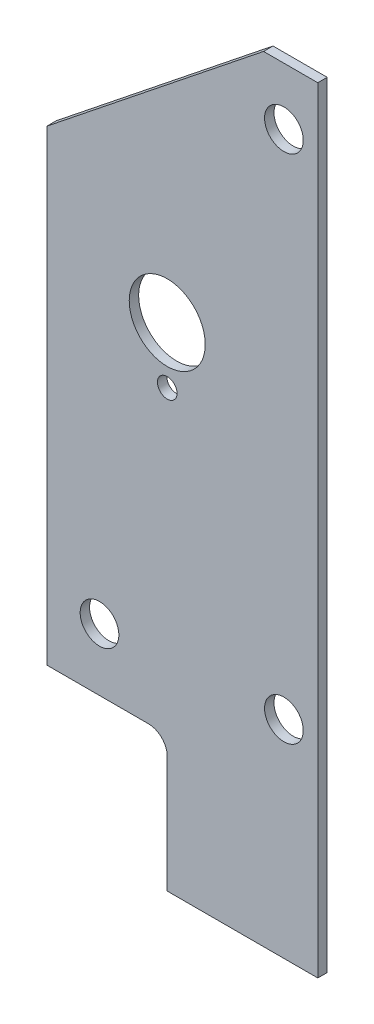
ISO-10303-21;
HEADER;
FILE_DESCRIPTION(('STEP AP214'),'2;1');
FILE_NAME('part.step','',(''),(''),'','','');
FILE_SCHEMA(('AUTOMOTIVE_DESIGN { 1 0 10303 214 1 1 1 1 }'));
ENDSEC;
DATA;
#1=APPLICATION_CONTEXT('core data for automotive mechanical design processes');
#2=APPLICATION_PROTOCOL_DEFINITION('international standard','automotive_design',2000,#1);
#3=PRODUCT_CONTEXT('',#1,'mechanical');
#4=PRODUCT('Part','Part','',(#3));
#5=PRODUCT_RELATED_PRODUCT_CATEGORY('part','',(#4));
#6=PRODUCT_DEFINITION_FORMATION('','',#4);
#7=PRODUCT_DEFINITION_CONTEXT('part definition',#1,'design');
#8=PRODUCT_DEFINITION('design','',#6,#7);
#9=PRODUCT_DEFINITION_SHAPE('','',#8);
#10=(LENGTH_UNIT() NAMED_UNIT(*) SI_UNIT(.MILLI.,.METRE.));
#11=(NAMED_UNIT(*) PLANE_ANGLE_UNIT() SI_UNIT($,.RADIAN.));
#12=(NAMED_UNIT(*) SI_UNIT($,.STERADIAN.) SOLID_ANGLE_UNIT());
#13=UNCERTAINTY_MEASURE_WITH_UNIT(LENGTH_MEASURE(1.E-05),#10,'distance_accuracy_value','');
#14=(GEOMETRIC_REPRESENTATION_CONTEXT(3) GLOBAL_UNCERTAINTY_ASSIGNED_CONTEXT((#13)) GLOBAL_UNIT_ASSIGNED_CONTEXT((#10,
#11,#12)) REPRESENTATION_CONTEXT('',''));
#15=CARTESIAN_POINT('',(0.,0.,0.));
#16=DIRECTION('',(0.,0.,1.));
#17=DIRECTION('',(1.,0.,0.));
#18=AXIS2_PLACEMENT_3D('',#15,#16,#17);
#19=CARTESIAN_POINT('',(-22.86,65.405,1.5875));
#20=DIRECTION('',(0.,0.,1.));
#21=DIRECTION('',(1.,0.,0.));
#22=AXIS2_PLACEMENT_3D('',#19,#20,#21);
#23=PLANE('',#22);
#24=CARTESIAN_POINT('',(-5.715,121.158,1.5875));
#25=DIRECTION('',(0.,0.,-1.));
#26=DIRECTION('',(-1.,0.,0.));
#27=AXIS2_PLACEMENT_3D('',#24,#25,#26);
#28=CIRCLE('',#27,3.2639);
#29=CARTESIAN_POINT('',(-8.9789,121.158,1.5875));
#30=VERTEX_POINT('',#29);
#31=EDGE_CURVE('E136',#30,#30,#28,.T.);
#32=ORIENTED_EDGE('',*,*,#31,.T.);
#33=EDGE_LOOP('',(#32));
#34=FACE_BOUND('',#33,.T.);
#35=CARTESIAN_POINT('',(-5.715,34.925,1.5875));
#36=DIRECTION('',(0.,0.,-1.));
#37=DIRECTION('',(-1.,0.,0.));
#38=AXIS2_PLACEMENT_3D('',#35,#36,#37);
#39=CIRCLE('',#38,3.2639);
#40=CARTESIAN_POINT('',(-8.9789,34.925,1.5875));
#41=VERTEX_POINT('',#40);
#42=EDGE_CURVE('E188',#41,#41,#39,.T.);
#43=ORIENTED_EDGE('',*,*,#42,.T.);
#44=EDGE_LOOP('',(#43));
#45=FACE_BOUND('',#44,.T.);
#46=CARTESIAN_POINT('',(-36.83,33.3375,1.5875));
#47=DIRECTION('',(0.,0.,-1.));
#48=DIRECTION('',(-1.,0.,0.));
#49=AXIS2_PLACEMENT_3D('',#46,#47,#48);
#50=CIRCLE('',#49,3.2639);
#51=CARTESIAN_POINT('',(-40.0939,33.3375,1.5875));
#52=VERTEX_POINT('',#51);
#53=EDGE_CURVE('E191',#52,#52,#50,.T.);
#54=ORIENTED_EDGE('',*,*,#53,.T.);
#55=EDGE_LOOP('',(#54));
#56=FACE_BOUND('',#55,.T.);
#57=CARTESIAN_POINT('',(-25.4,83.058,1.5875));
#58=DIRECTION('',(0.,0.,-1.));
#59=DIRECTION('',(-1.,0.,0.));
#60=AXIS2_PLACEMENT_3D('',#57,#58,#59);
#61=CIRCLE('',#60,6.4135);
#62=CARTESIAN_POINT('',(-31.8135,83.058,1.5875));
#63=VERTEX_POINT('',#62);
#64=EDGE_CURVE('E194',#63,#63,#61,.T.);
#65=ORIENTED_EDGE('',*,*,#64,.T.);
#66=EDGE_LOOP('',(#65));
#67=FACE_BOUND('',#66,.T.);
#68=CARTESIAN_POINT('',(-25.4,73.533,1.5875));
#69=DIRECTION('',(0.,0.,-1.));
#70=DIRECTION('',(-1.,0.,0.));
#71=AXIS2_PLACEMENT_3D('',#68,#69,#70);
#72=CIRCLE('',#71,1.651);
#73=CARTESIAN_POINT('',(-27.051,73.533,1.5875));
#74=VERTEX_POINT('',#73);
#75=EDGE_CURVE('E196',#74,#74,#72,.T.);
#76=ORIENTED_EDGE('',*,*,#75,.T.);
#77=EDGE_LOOP('',(#76));
#78=FACE_BOUND('',#77,.T.);
#79=DIRECTION('',(1.,0.,0.));
#80=VECTOR('',#79,1.);
#81=CARTESIAN_POINT('',(-25.4,0.,1.5875));
#82=LINE('',#81,#80);
#83=CARTESIAN_POINT('',(0.,0.,1.5875));
#84=VERTEX_POINT('',#83);
#85=CARTESIAN_POINT('',(-25.4,0.,1.5875));
#86=VERTEX_POINT('',#85);
#87=EDGE_CURVE('E96',#84,#86,#82,.F.);
#88=ORIENTED_EDGE('',*,*,#87,.F.);
#89=DIRECTION('',(0.,1.,0.));
#90=VECTOR('',#89,1.);
#91=CARTESIAN_POINT('',(0.,0.,1.5875));
#92=LINE('',#91,#90);
#93=CARTESIAN_POINT('',(0.,130.81,1.5875));
#94=VERTEX_POINT('',#93);
#95=EDGE_CURVE('E114',#94,#84,#92,.F.);
#96=ORIENTED_EDGE('',*,*,#95,.F.);
#97=DIRECTION('',(1.,0.,0.));
#98=VECTOR('',#97,1.);
#99=CARTESIAN_POINT('',(0.,130.81,1.5875));
#100=LINE('',#99,#98);
#101=CARTESIAN_POINT('',(-9.144,130.81,1.5875));
#102=VERTEX_POINT('',#101);
#103=EDGE_CURVE('E142',#102,#94,#100,.T.);
#104=ORIENTED_EDGE('',*,*,#103,.F.);
#105=DIRECTION('',(-0.78139793143184,-0.624033070240706,0.));
#106=VECTOR('',#105,1.);
#107=CARTESIAN_POINT('',(-9.144,130.81,1.5875));
#108=LINE('',#107,#106);
#109=CARTESIAN_POINT('',(-45.72,101.6,1.5875));
#110=VERTEX_POINT('',#109);
#111=EDGE_CURVE('E151',#110,#102,#108,.F.);
#112=ORIENTED_EDGE('',*,*,#111,.F.);
#113=DIRECTION('',(0.,1.,0.));
#114=VECTOR('',#113,1.);
#115=CARTESIAN_POINT('',(-45.72,101.6,1.5875));
#116=LINE('',#115,#114);
#117=CARTESIAN_POINT('',(-45.72,22.86,1.5875));
#118=VERTEX_POINT('',#117);
#119=EDGE_CURVE('E131',#118,#110,#116,.T.);
#120=ORIENTED_EDGE('',*,*,#119,.F.);
#121=DIRECTION('',(1.,0.,0.));
#122=VECTOR('',#121,1.);
#123=CARTESIAN_POINT('',(-45.72,22.86,1.5875));
#124=LINE('',#123,#122);
#125=CARTESIAN_POINT('',(-28.575,22.86,1.5875));
#126=VERTEX_POINT('',#125);
#127=EDGE_CURVE('E79',#126,#118,#124,.F.);
#128=ORIENTED_EDGE('',*,*,#127,.F.);
#129=CARTESIAN_POINT('',(-28.575,19.685,1.5875));
#130=DIRECTION('',(0.,0.,1.));
#131=DIRECTION('',(1.,0.,0.));
#132=AXIS2_PLACEMENT_3D('',#129,#130,#131);
#133=CIRCLE('',#132,3.175);
#134=CARTESIAN_POINT('',(-25.4,19.685,1.5875));
#135=VERTEX_POINT('',#134);
#136=EDGE_CURVE('E20',#126,#135,#133,.F.);
#137=ORIENTED_EDGE('',*,*,#136,.T.);
#138=DIRECTION('',(0.,1.,0.));
#139=VECTOR('',#138,1.);
#140=CARTESIAN_POINT('',(-25.4,22.86,1.5875));
#141=LINE('',#140,#139);
#142=EDGE_CURVE('E84',#86,#135,#141,.T.);
#143=ORIENTED_EDGE('',*,*,#142,.F.);
#144=EDGE_LOOP('',(#88,#96,#104,#112,#120,#128,#137,#143));
#145=FACE_BOUND('',#144,.T.);
#146=ADVANCED_FACE('F17',(#34,#45,#56,#67,#78,#145),#23,.T.);
#147=CARTESIAN_POINT('',(-9.144,130.81,0.));
#148=DIRECTION('',(-0.624033070240706,0.78139793143184,0.));
#149=DIRECTION('',(-0.78139793143184,-0.624033070240706,0.));
#150=AXIS2_PLACEMENT_3D('',#147,#148,#149);
#151=PLANE('',#150);
#152=ORIENTED_EDGE('',*,*,#111,.T.);
#153=DIRECTION('',(0.,0.,1.));
#154=VECTOR('',#153,1.);
#155=CARTESIAN_POINT('',(-9.144,130.81,0.));
#156=LINE('',#155,#154);
#157=CARTESIAN_POINT('',(-9.144,130.81,0.));
#158=VERTEX_POINT('',#157);
#159=EDGE_CURVE('E139',#158,#102,#156,.T.);
#160=ORIENTED_EDGE('',*,*,#159,.F.);
#161=DIRECTION('',(-0.78139793143184,-0.624033070240706,0.));
#162=VECTOR('',#161,1.);
#163=CARTESIAN_POINT('',(-9.144,130.81,0.));
#164=LINE('',#163,#162);
#165=CARTESIAN_POINT('',(-45.72,101.6,0.));
#166=VERTEX_POINT('',#165);
#167=EDGE_CURVE('E126',#158,#166,#164,.T.);
#168=ORIENTED_EDGE('',*,*,#167,.T.);
#169=DIRECTION('',(0.,0.,1.));
#170=VECTOR('',#169,1.);
#171=CARTESIAN_POINT('',(-45.72,101.6,0.));
#172=LINE('',#171,#170);
#173=EDGE_CURVE('E129',#110,#166,#172,.F.);
#174=ORIENTED_EDGE('',*,*,#173,.F.);
#175=EDGE_LOOP('',(#152,#160,#168,#174));
#176=FACE_BOUND('',#175,.T.);
#177=ADVANCED_FACE('F244',(#176),#151,.T.);
#178=CARTESIAN_POINT('',(-45.72,101.6,0.));
#179=DIRECTION('',(-1.,0.,0.));
#180=DIRECTION('',(0.,0.,1.));
#181=AXIS2_PLACEMENT_3D('',#178,#179,#180);
#182=PLANE('',#181);
#183=ORIENTED_EDGE('',*,*,#119,.T.);
#184=ORIENTED_EDGE('',*,*,#173,.T.);
#185=DIRECTION('',(0.,1.,0.));
#186=VECTOR('',#185,1.);
#187=CARTESIAN_POINT('',(-45.72,65.405,0.));
#188=LINE('',#187,#186);
#189=CARTESIAN_POINT('',(-45.72,22.86,0.));
#190=VERTEX_POINT('',#189);
#191=EDGE_CURVE('E122',#166,#190,#188,.F.);
#192=ORIENTED_EDGE('',*,*,#191,.T.);
#193=DIRECTION('',(0.,0.,1.));
#194=VECTOR('',#193,1.);
#195=CARTESIAN_POINT('',(-45.72,22.86,0.));
#196=LINE('',#195,#194);
#197=EDGE_CURVE('E118',#118,#190,#196,.F.);
#198=ORIENTED_EDGE('',*,*,#197,.F.);
#199=EDGE_LOOP('',(#183,#184,#192,#198));
#200=FACE_BOUND('',#199,.T.);
#201=ADVANCED_FACE('F251',(#200),#182,.T.);
#202=CARTESIAN_POINT('',(-45.72,22.86,0.));
#203=DIRECTION('',(0.,-1.,0.));
#204=DIRECTION('',(1.,0.,0.));
#205=AXIS2_PLACEMENT_3D('',#202,#203,#204);
#206=PLANE('',#205);
#207=ORIENTED_EDGE('',*,*,#197,.T.);
#208=DIRECTION('',(1.,0.,0.));
#209=VECTOR('',#208,1.);
#210=CARTESIAN_POINT('',(-22.86,22.86,0.));
#211=LINE('',#210,#209);
#212=CARTESIAN_POINT('',(-28.575,22.86,0.));
#213=VERTEX_POINT('',#212);
#214=EDGE_CURVE('E125',#190,#213,#211,.T.);
#215=ORIENTED_EDGE('',*,*,#214,.T.);
#216=DIRECTION('',(0.,0.,1.));
#217=VECTOR('',#216,1.);
#218=CARTESIAN_POINT('',(-28.575,22.86,0.));
#219=LINE('',#218,#217);
#220=EDGE_CURVE('E90',#213,#126,#219,.T.);
#221=ORIENTED_EDGE('',*,*,#220,.T.);
#222=ORIENTED_EDGE('',*,*,#127,.T.);
#223=EDGE_LOOP('',(#207,#215,#221,#222));
#224=FACE_BOUND('',#223,.T.);
#225=ADVANCED_FACE('F261',(#224),#206,.T.);
#226=CARTESIAN_POINT('',(-28.575,19.685,0.));
#227=DIRECTION('',(0.,0.,1.));
#228=DIRECTION('',(1.,0.,0.));
#229=AXIS2_PLACEMENT_3D('',#226,#227,#228);
#230=CYLINDRICAL_SURFACE('',#229,3.175);
#231=DIRECTION('',(0.,0.,1.));
#232=VECTOR('',#231,1.);
#233=CARTESIAN_POINT('',(-25.4,19.685,0.));
#234=LINE('',#233,#232);
#235=CARTESIAN_POINT('',(-25.4,19.685,0.));
#236=VERTEX_POINT('',#235);
#237=EDGE_CURVE('E89',#135,#236,#234,.F.);
#238=ORIENTED_EDGE('',*,*,#237,.F.);
#239=ORIENTED_EDGE('',*,*,#136,.F.);
#240=ORIENTED_EDGE('',*,*,#220,.F.);
#241=CARTESIAN_POINT('',(-28.575,19.685,0.));
#242=DIRECTION('',(0.,0.,1.));
#243=DIRECTION('',(1.,0.,0.));
#244=AXIS2_PLACEMENT_3D('',#241,#242,#243);
#245=CIRCLE('',#244,3.175);
#246=EDGE_CURVE('E101',#213,#236,#245,.F.);
#247=ORIENTED_EDGE('',*,*,#246,.T.);
#248=EDGE_LOOP('',(#238,#239,#240,#247));
#249=FACE_BOUND('',#248,.T.);
#250=ADVANCED_FACE('F99',(#249),#230,.F.);
#251=CARTESIAN_POINT('',(-25.4,22.86,0.));
#252=DIRECTION('',(-1.,0.,0.));
#253=DIRECTION('',(0.,0.,1.));
#254=AXIS2_PLACEMENT_3D('',#251,#252,#253);
#255=PLANE('',#254);
#256=DIRECTION('',(0.,0.,-1.));
#257=VECTOR('',#256,1.);
#258=CARTESIAN_POINT('',(-25.4,0.,0.));
#259=LINE('',#258,#257);
#260=CARTESIAN_POINT('',(-25.4,0.,0.));
#261=VERTEX_POINT('',#260);
#262=EDGE_CURVE('E95',#86,#261,#259,.T.);
#263=ORIENTED_EDGE('',*,*,#262,.F.);
#264=ORIENTED_EDGE('',*,*,#142,.T.);
#265=ORIENTED_EDGE('',*,*,#237,.T.);
#266=DIRECTION('',(0.,1.,0.));
#267=VECTOR('',#266,1.);
#268=CARTESIAN_POINT('',(-25.4,65.405,0.));
#269=LINE('',#268,#267);
#270=EDGE_CURVE('E110',#236,#261,#269,.F.);
#271=ORIENTED_EDGE('',*,*,#270,.T.);
#272=EDGE_LOOP('',(#263,#264,#265,#271));
#273=FACE_BOUND('',#272,.T.);
#274=ADVANCED_FACE('F92',(#273),#255,.T.);
#275=CARTESIAN_POINT('',(-25.4,0.,0.));
#276=DIRECTION('',(0.,-1.,0.));
#277=DIRECTION('',(0.,0.,-1.));
#278=AXIS2_PLACEMENT_3D('',#275,#276,#277);
#279=PLANE('',#278);
#280=ORIENTED_EDGE('',*,*,#87,.T.);
#281=ORIENTED_EDGE('',*,*,#262,.T.);
#282=DIRECTION('',(1.,0.,0.));
#283=VECTOR('',#282,1.);
#284=CARTESIAN_POINT('',(-22.86,0.,0.));
#285=LINE('',#284,#283);
#286=CARTESIAN_POINT('',(0.,0.,0.));
#287=VERTEX_POINT('',#286);
#288=EDGE_CURVE('E106',#261,#287,#285,.T.);
#289=ORIENTED_EDGE('',*,*,#288,.T.);
#290=DIRECTION('',(0.,0.,1.));
#291=VECTOR('',#290,1.);
#292=CARTESIAN_POINT('',(0.,0.,0.));
#293=LINE('',#292,#291);
#294=EDGE_CURVE('E143',#84,#287,#293,.F.);
#295=ORIENTED_EDGE('',*,*,#294,.F.);
#296=EDGE_LOOP('',(#280,#281,#289,#295));
#297=FACE_BOUND('',#296,.T.);
#298=ADVANCED_FACE('F272',(#297),#279,.T.);
#299=CARTESIAN_POINT('',(0.,0.,0.));
#300=DIRECTION('',(1.,0.,0.));
#301=DIRECTION('',(0.,1.,0.));
#302=AXIS2_PLACEMENT_3D('',#299,#300,#301);
#303=PLANE('',#302);
#304=ORIENTED_EDGE('',*,*,#95,.T.);
#305=ORIENTED_EDGE('',*,*,#294,.T.);
#306=DIRECTION('',(0.,1.,0.));
#307=VECTOR('',#306,1.);
#308=CARTESIAN_POINT('',(0.,65.405,0.));
#309=LINE('',#308,#307);
#310=CARTESIAN_POINT('',(0.,130.81,0.));
#311=VERTEX_POINT('',#310);
#312=EDGE_CURVE('E109',#287,#311,#309,.T.);
#313=ORIENTED_EDGE('',*,*,#312,.T.);
#314=DIRECTION('',(0.,0.,1.));
#315=VECTOR('',#314,1.);
#316=CARTESIAN_POINT('',(0.,130.81,0.));
#317=LINE('',#316,#315);
#318=EDGE_CURVE('E35',#94,#311,#317,.F.);
#319=ORIENTED_EDGE('',*,*,#318,.F.);
#320=EDGE_LOOP('',(#304,#305,#313,#319));
#321=FACE_BOUND('',#320,.T.);
#322=ADVANCED_FACE('F215',(#321),#303,.T.);
#323=CARTESIAN_POINT('',(0.,130.81,0.));
#324=DIRECTION('',(0.,1.,0.));
#325=DIRECTION('',(0.,0.,1.));
#326=AXIS2_PLACEMENT_3D('',#323,#324,#325);
#327=PLANE('',#326);
#328=ORIENTED_EDGE('',*,*,#103,.T.);
#329=ORIENTED_EDGE('',*,*,#318,.T.);
#330=DIRECTION('',(1.,0.,0.));
#331=VECTOR('',#330,1.);
#332=CARTESIAN_POINT('',(-22.86,130.81,0.));
#333=LINE('',#332,#331);
#334=EDGE_CURVE('E146',#311,#158,#333,.F.);
#335=ORIENTED_EDGE('',*,*,#334,.T.);
#336=ORIENTED_EDGE('',*,*,#159,.T.);
#337=EDGE_LOOP('',(#328,#329,#335,#336));
#338=FACE_BOUND('',#337,.T.);
#339=ADVANCED_FACE('F204',(#338),#327,.T.);
#340=CARTESIAN_POINT('',(-25.4,73.533,1.5875));
#341=DIRECTION('',(0.,0.,-1.));
#342=DIRECTION('',(-1.,0.,0.));
#343=AXIS2_PLACEMENT_3D('',#340,#341,#342);
#344=CYLINDRICAL_SURFACE('',#343,1.651);
#345=CARTESIAN_POINT('',(-25.4,73.533,0.));
#346=DIRECTION('',(0.,0.,-1.));
#347=DIRECTION('',(-1.,0.,0.));
#348=AXIS2_PLACEMENT_3D('',#345,#346,#347);
#349=CIRCLE('',#348,1.651);
#350=CARTESIAN_POINT('',(-27.051,73.533,0.));
#351=VERTEX_POINT('',#350);
#352=EDGE_CURVE('E148',#351,#351,#349,.T.);
#353=ORIENTED_EDGE('',*,*,#352,.T.);
#354=EDGE_LOOP('',(#353));
#355=FACE_BOUND('',#354,.T.);
#356=ORIENTED_EDGE('',*,*,#75,.F.);
#357=EDGE_LOOP('',(#356));
#358=FACE_BOUND('',#357,.T.);
#359=ADVANCED_FACE('F201',(#355,#358),#344,.F.);
#360=CARTESIAN_POINT('',(-25.4,83.058,1.5875));
#361=DIRECTION('',(0.,0.,-1.));
#362=DIRECTION('',(-1.,0.,0.));
#363=AXIS2_PLACEMENT_3D('',#360,#361,#362);
#364=CYLINDRICAL_SURFACE('',#363,6.4135);
#365=CARTESIAN_POINT('',(-25.4,83.058,0.));
#366=DIRECTION('',(0.,0.,-1.));
#367=DIRECTION('',(-1.,0.,0.));
#368=AXIS2_PLACEMENT_3D('',#365,#366,#367);
#369=CIRCLE('',#368,6.4135);
#370=CARTESIAN_POINT('',(-31.8135,83.058,0.));
#371=VERTEX_POINT('',#370);
#372=EDGE_CURVE('E180',#371,#371,#369,.T.);
#373=ORIENTED_EDGE('',*,*,#372,.T.);
#374=EDGE_LOOP('',(#373));
#375=FACE_BOUND('',#374,.T.);
#376=ORIENTED_EDGE('',*,*,#64,.F.);
#377=EDGE_LOOP('',(#376));
#378=FACE_BOUND('',#377,.T.);
#379=ADVANCED_FACE('F203',(#375,#378),#364,.F.);
#380=CARTESIAN_POINT('',(-36.83,33.3375,1.5875));
#381=DIRECTION('',(0.,0.,-1.));
#382=DIRECTION('',(-1.,0.,0.));
#383=AXIS2_PLACEMENT_3D('',#380,#381,#382);
#384=CYLINDRICAL_SURFACE('',#383,3.2639);
#385=CARTESIAN_POINT('',(-36.83,33.3375,0.));
#386=DIRECTION('',(0.,0.,-1.));
#387=DIRECTION('',(-1.,0.,0.));
#388=AXIS2_PLACEMENT_3D('',#385,#386,#387);
#389=CIRCLE('',#388,3.2639);
#390=CARTESIAN_POINT('',(-40.0939,33.3375,0.));
#391=VERTEX_POINT('',#390);
#392=EDGE_CURVE('E177',#391,#391,#389,.T.);
#393=ORIENTED_EDGE('',*,*,#392,.T.);
#394=EDGE_LOOP('',(#393));
#395=FACE_BOUND('',#394,.T.);
#396=ORIENTED_EDGE('',*,*,#53,.F.);
#397=EDGE_LOOP('',(#396));
#398=FACE_BOUND('',#397,.T.);
#399=ADVANCED_FACE('F212',(#395,#398),#384,.F.);
#400=CARTESIAN_POINT('',(-5.715,34.925,1.5875));
#401=DIRECTION('',(0.,0.,-1.));
#402=DIRECTION('',(-1.,0.,0.));
#403=AXIS2_PLACEMENT_3D('',#400,#401,#402);
#404=CYLINDRICAL_SURFACE('',#403,3.2639);
#405=CARTESIAN_POINT('',(-5.715,34.925,0.));
#406=DIRECTION('',(0.,0.,-1.));
#407=DIRECTION('',(-1.,0.,0.));
#408=AXIS2_PLACEMENT_3D('',#405,#406,#407);
#409=CIRCLE('',#408,3.2639);
#410=CARTESIAN_POINT('',(-8.9789,34.925,0.));
#411=VERTEX_POINT('',#410);
#412=EDGE_CURVE('E26',#411,#411,#409,.T.);
#413=ORIENTED_EDGE('',*,*,#412,.T.);
#414=EDGE_LOOP('',(#413));
#415=FACE_BOUND('',#414,.T.);
#416=ORIENTED_EDGE('',*,*,#42,.F.);
#417=EDGE_LOOP('',(#416));
#418=FACE_BOUND('',#417,.T.);
#419=ADVANCED_FACE('F225',(#415,#418),#404,.F.);
#420=CARTESIAN_POINT('',(-5.715,121.158,1.5875));
#421=DIRECTION('',(0.,0.,-1.));
#422=DIRECTION('',(-1.,0.,0.));
#423=AXIS2_PLACEMENT_3D('',#420,#421,#422);
#424=CYLINDRICAL_SURFACE('',#423,3.2639);
#425=CARTESIAN_POINT('',(-5.715,121.158,0.));
#426=DIRECTION('',(0.,0.,-1.));
#427=DIRECTION('',(-1.,0.,0.));
#428=AXIS2_PLACEMENT_3D('',#425,#426,#427);
#429=CIRCLE('',#428,3.2639);
#430=CARTESIAN_POINT('',(-8.9789,121.158,0.));
#431=VERTEX_POINT('',#430);
#432=EDGE_CURVE('E11',#431,#431,#429,.T.);
#433=ORIENTED_EDGE('',*,*,#432,.T.);
#434=EDGE_LOOP('',(#433));
#435=FACE_BOUND('',#434,.T.);
#436=ORIENTED_EDGE('',*,*,#31,.F.);
#437=EDGE_LOOP('',(#436));
#438=FACE_BOUND('',#437,.T.);
#439=ADVANCED_FACE('F219',(#435,#438),#424,.F.);
#440=CARTESIAN_POINT('',(-22.86,65.405,0.));
#441=DIRECTION('',(0.,0.,1.));
#442=DIRECTION('',(1.,0.,0.));
#443=AXIS2_PLACEMENT_3D('',#440,#441,#442);
#444=PLANE('',#443);
#445=ORIENTED_EDGE('',*,*,#432,.F.);
#446=EDGE_LOOP('',(#445));
#447=FACE_BOUND('',#446,.T.);
#448=ORIENTED_EDGE('',*,*,#412,.F.);
#449=EDGE_LOOP('',(#448));
#450=FACE_BOUND('',#449,.T.);
#451=ORIENTED_EDGE('',*,*,#392,.F.);
#452=EDGE_LOOP('',(#451));
#453=FACE_BOUND('',#452,.T.);
#454=ORIENTED_EDGE('',*,*,#372,.F.);
#455=EDGE_LOOP('',(#454));
#456=FACE_BOUND('',#455,.T.);
#457=ORIENTED_EDGE('',*,*,#352,.F.);
#458=EDGE_LOOP('',(#457));
#459=FACE_BOUND('',#458,.T.);
#460=ORIENTED_EDGE('',*,*,#312,.F.);
#461=ORIENTED_EDGE('',*,*,#288,.F.);
#462=ORIENTED_EDGE('',*,*,#270,.F.);
#463=ORIENTED_EDGE('',*,*,#246,.F.);
#464=ORIENTED_EDGE('',*,*,#214,.F.);
#465=ORIENTED_EDGE('',*,*,#191,.F.);
#466=ORIENTED_EDGE('',*,*,#167,.F.);
#467=ORIENTED_EDGE('',*,*,#334,.F.);
#468=EDGE_LOOP('',(#460,#461,#462,#463,#464,#465,#466,#467));
#469=FACE_BOUND('',#468,.T.);
#470=ADVANCED_FACE('F217',(#447,#450,#453,#456,#459,#469),#444,.F.);
#471=CLOSED_SHELL('',(#146,#177,#201,#225,#250,#274,#298,#322,#339,#359,#379,#399,#419,#439,#470));
#472=MANIFOLD_SOLID_BREP('B1',#471);
#473=ADVANCED_BREP_SHAPE_REPRESENTATION('',(#18,#472),#14);
#474=SHAPE_DEFINITION_REPRESENTATION(#9,#473);
ENDSEC;
END-ISO-10303-21;
